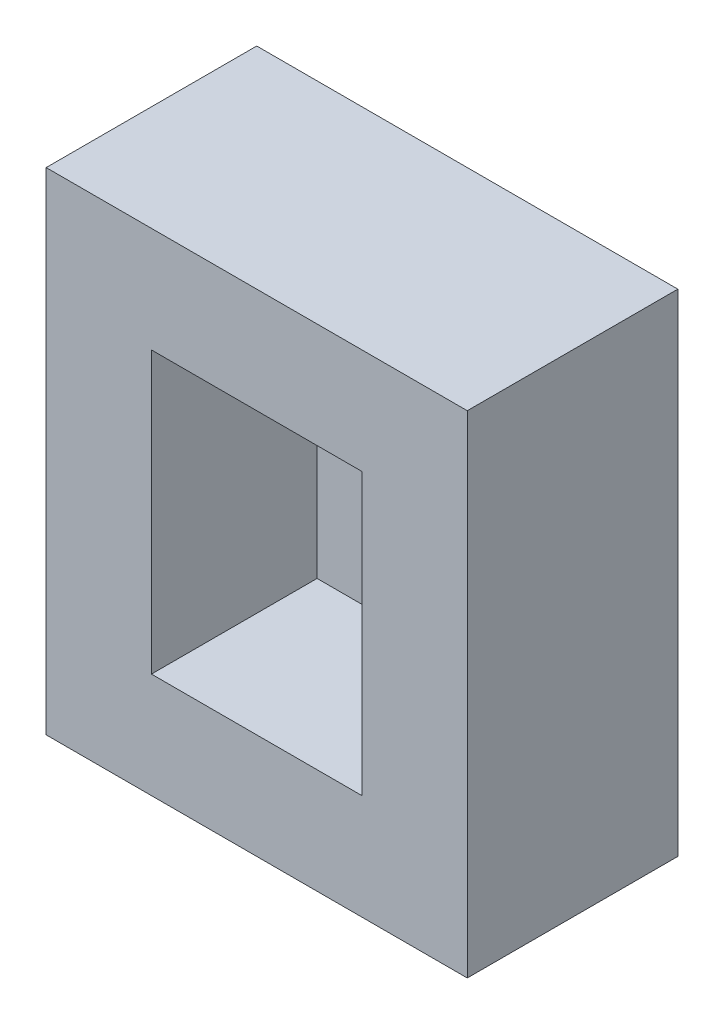
ISO-10303-21;
HEADER;
FILE_DESCRIPTION(('STEP AP214'),'2;1');
FILE_NAME('part.step','',(''),(''),'','','');
FILE_SCHEMA(('AUTOMOTIVE_DESIGN { 1 0 10303 214 1 1 1 1 }'));
ENDSEC;
DATA;
#1=APPLICATION_CONTEXT('core data for automotive mechanical design processes');
#2=APPLICATION_PROTOCOL_DEFINITION('international standard','automotive_design',2000,#1);
#3=PRODUCT_CONTEXT('',#1,'mechanical');
#4=PRODUCT('Part','Part','',(#3));
#5=PRODUCT_RELATED_PRODUCT_CATEGORY('part','',(#4));
#6=PRODUCT_DEFINITION_FORMATION('','',#4);
#7=PRODUCT_DEFINITION_CONTEXT('part definition',#1,'design');
#8=PRODUCT_DEFINITION('design','',#6,#7);
#9=PRODUCT_DEFINITION_SHAPE('','',#8);
#10=(LENGTH_UNIT() NAMED_UNIT(*) SI_UNIT(.MILLI.,.METRE.));
#11=(NAMED_UNIT(*) PLANE_ANGLE_UNIT() SI_UNIT($,.RADIAN.));
#12=(NAMED_UNIT(*) SI_UNIT($,.STERADIAN.) SOLID_ANGLE_UNIT());
#13=UNCERTAINTY_MEASURE_WITH_UNIT(LENGTH_MEASURE(1.E-05),#10,'distance_accuracy_value','');
#14=(GEOMETRIC_REPRESENTATION_CONTEXT(3) GLOBAL_UNCERTAINTY_ASSIGNED_CONTEXT((#13)) GLOBAL_UNIT_ASSIGNED_CONTEXT((#10,
#11,#12)) REPRESENTATION_CONTEXT('',''));
#15=CARTESIAN_POINT('',(0.,0.,0.));
#16=DIRECTION('',(0.,0.,1.));
#17=DIRECTION('',(1.,0.,0.));
#18=AXIS2_PLACEMENT_3D('',#15,#16,#17);
#19=CARTESIAN_POINT('',(0.,711.2,0.));
#20=DIRECTION('',(0.,0.,-1.));
#21=DIRECTION('',(-1.,0.,0.));
#22=AXIS2_PLACEMENT_3D('',#19,#20,#21);
#23=PLANE('',#22);
#24=DIRECTION('',(1.,0.,0.));
#25=VECTOR('',#24,1.);
#26=CARTESIAN_POINT('',(0.,0.,0.));
#27=LINE('',#26,#25);
#28=CARTESIAN_POINT('',(0.,0.,0.));
#29=VERTEX_POINT('',#28);
#30=CARTESIAN_POINT('',(609.6,0.,0.));
#31=VERTEX_POINT('',#30);
#32=EDGE_CURVE('E153',#29,#31,#27,.T.);
#33=ORIENTED_EDGE('',*,*,#32,.T.);
#34=DIRECTION('',(0.,-1.,0.));
#35=VECTOR('',#34,1.);
#36=CARTESIAN_POINT('',(609.6,711.2,0.));
#37=LINE('',#36,#35);
#38=CARTESIAN_POINT('',(609.6,711.2,0.));
#39=VERTEX_POINT('',#38);
#40=EDGE_CURVE('E48',#39,#31,#37,.T.);
#41=ORIENTED_EDGE('',*,*,#40,.F.);
#42=DIRECTION('',(1.,0.,0.));
#43=VECTOR('',#42,1.);
#44=CARTESIAN_POINT('',(0.,711.2,0.));
#45=LINE('',#44,#43);
#46=CARTESIAN_POINT('',(0.,711.2,0.));
#47=VERTEX_POINT('',#46);
#48=EDGE_CURVE('E157',#47,#39,#45,.T.);
#49=ORIENTED_EDGE('',*,*,#48,.F.);
#50=DIRECTION('',(0.,-1.,0.));
#51=VECTOR('',#50,1.);
#52=CARTESIAN_POINT('',(0.,711.2,0.));
#53=LINE('',#52,#51);
#54=EDGE_CURVE('E11',#47,#29,#53,.T.);
#55=ORIENTED_EDGE('',*,*,#54,.T.);
#56=EDGE_LOOP('',(#33,#41,#49,#55));
#57=FACE_BOUND('',#56,.T.);
#58=DIRECTION('',(1.,0.,0.));
#59=VECTOR('',#58,1.);
#60=CARTESIAN_POINT('',(152.4,558.8,0.));
#61=LINE('',#60,#59);
#62=CARTESIAN_POINT('',(152.4,558.8,0.));
#63=VERTEX_POINT('',#62);
#64=CARTESIAN_POINT('',(457.2,558.8,0.));
#65=VERTEX_POINT('',#64);
#66=EDGE_CURVE('E56',#63,#65,#61,.T.);
#67=ORIENTED_EDGE('',*,*,#66,.T.);
#68=DIRECTION('',(0.,1.,0.));
#69=VECTOR('',#68,1.);
#70=CARTESIAN_POINT('',(457.2,152.4,0.));
#71=LINE('',#70,#69);
#72=CARTESIAN_POINT('',(457.2,152.4,0.));
#73=VERTEX_POINT('',#72);
#74=EDGE_CURVE('E127',#73,#65,#71,.T.);
#75=ORIENTED_EDGE('',*,*,#74,.F.);
#76=DIRECTION('',(1.,0.,0.));
#77=VECTOR('',#76,1.);
#78=CARTESIAN_POINT('',(152.4,152.4,0.));
#79=LINE('',#78,#77);
#80=CARTESIAN_POINT('',(152.4,152.4,0.));
#81=VERTEX_POINT('',#80);
#82=EDGE_CURVE('E141',#81,#73,#79,.T.);
#83=ORIENTED_EDGE('',*,*,#82,.F.);
#84=DIRECTION('',(0.,1.,0.));
#85=VECTOR('',#84,1.);
#86=CARTESIAN_POINT('',(152.4,152.4,0.));
#87=LINE('',#86,#85);
#88=EDGE_CURVE('E120',#81,#63,#87,.T.);
#89=ORIENTED_EDGE('',*,*,#88,.T.);
#90=EDGE_LOOP('',(#67,#75,#83,#89));
#91=FACE_BOUND('',#90,.T.);
#92=ADVANCED_FACE('F39',(#57,#91),#23,.F.);
#93=CARTESIAN_POINT('',(0.,711.2,0.));
#94=DIRECTION('',(-1.,0.,0.));
#95=DIRECTION('',(0.,0.,1.));
#96=AXIS2_PLACEMENT_3D('',#93,#94,#95);
#97=PLANE('',#96);
#98=DIRECTION('',(0.,0.,-1.));
#99=VECTOR('',#98,1.);
#100=CARTESIAN_POINT('',(0.,0.,0.));
#101=LINE('',#100,#99);
#102=CARTESIAN_POINT('',(0.,0.,-304.8));
#103=VERTEX_POINT('',#102);
#104=EDGE_CURVE('E128',#29,#103,#101,.T.);
#105=ORIENTED_EDGE('',*,*,#104,.F.);
#106=ORIENTED_EDGE('',*,*,#54,.F.);
#107=DIRECTION('',(0.,0.,-1.));
#108=VECTOR('',#107,1.);
#109=CARTESIAN_POINT('',(0.,711.2,0.));
#110=LINE('',#109,#108);
#111=CARTESIAN_POINT('',(0.,711.2,-304.8));
#112=VERTEX_POINT('',#111);
#113=EDGE_CURVE('E150',#47,#112,#110,.T.);
#114=ORIENTED_EDGE('',*,*,#113,.T.);
#115=DIRECTION('',(0.,-1.,0.));
#116=VECTOR('',#115,1.);
#117=CARTESIAN_POINT('',(0.,711.2,-304.8));
#118=LINE('',#117,#116);
#119=EDGE_CURVE('E43',#112,#103,#118,.T.);
#120=ORIENTED_EDGE('',*,*,#119,.T.);
#121=EDGE_LOOP('',(#105,#106,#114,#120));
#122=FACE_BOUND('',#121,.T.);
#123=ADVANCED_FACE('F41',(#122),#97,.T.);
#124=CARTESIAN_POINT('',(609.6,711.2,0.));
#125=DIRECTION('',(-1.,0.,0.));
#126=DIRECTION('',(0.,0.,1.));
#127=AXIS2_PLACEMENT_3D('',#124,#125,#126);
#128=PLANE('',#127);
#129=DIRECTION('',(0.,0.,-1.));
#130=VECTOR('',#129,1.);
#131=CARTESIAN_POINT('',(609.6,0.,0.));
#132=LINE('',#131,#130);
#133=CARTESIAN_POINT('',(609.6,0.,-304.8));
#134=VERTEX_POINT('',#133);
#135=EDGE_CURVE('E164',#31,#134,#132,.T.);
#136=ORIENTED_EDGE('',*,*,#135,.T.);
#137=DIRECTION('',(0.,-1.,0.));
#138=VECTOR('',#137,1.);
#139=CARTESIAN_POINT('',(609.6,711.2,-304.8));
#140=LINE('',#139,#138);
#141=CARTESIAN_POINT('',(609.6,711.2,-304.8));
#142=VERTEX_POINT('',#141);
#143=EDGE_CURVE('E169',#142,#134,#140,.T.);
#144=ORIENTED_EDGE('',*,*,#143,.F.);
#145=DIRECTION('',(0.,0.,-1.));
#146=VECTOR('',#145,1.);
#147=CARTESIAN_POINT('',(609.6,711.2,0.));
#148=LINE('',#147,#146);
#149=EDGE_CURVE('E155',#39,#142,#148,.T.);
#150=ORIENTED_EDGE('',*,*,#149,.F.);
#151=ORIENTED_EDGE('',*,*,#40,.T.);
#152=EDGE_LOOP('',(#136,#144,#150,#151));
#153=FACE_BOUND('',#152,.T.);
#154=ADVANCED_FACE('F180',(#153),#128,.F.);
#155=CARTESIAN_POINT('',(0.,711.2,-304.8));
#156=DIRECTION('',(0.,0.,-1.));
#157=DIRECTION('',(-1.,0.,0.));
#158=AXIS2_PLACEMENT_3D('',#155,#156,#157);
#159=PLANE('',#158);
#160=DIRECTION('',(1.,0.,0.));
#161=VECTOR('',#160,1.);
#162=CARTESIAN_POINT('',(0.,0.,-304.8));
#163=LINE('',#162,#161);
#164=EDGE_CURVE('E161',#103,#134,#163,.T.);
#165=ORIENTED_EDGE('',*,*,#164,.F.);
#166=ORIENTED_EDGE('',*,*,#119,.F.);
#167=DIRECTION('',(1.,0.,0.));
#168=VECTOR('',#167,1.);
#169=CARTESIAN_POINT('',(0.,711.2,-304.8));
#170=LINE('',#169,#168);
#171=EDGE_CURVE('E152',#112,#142,#170,.T.);
#172=ORIENTED_EDGE('',*,*,#171,.T.);
#173=ORIENTED_EDGE('',*,*,#143,.T.);
#174=EDGE_LOOP('',(#165,#166,#172,#173));
#175=FACE_BOUND('',#174,.T.);
#176=ADVANCED_FACE('F172',(#175),#159,.T.);
#177=CARTESIAN_POINT('',(0.,711.2,0.));
#178=DIRECTION('',(0.,-1.,0.));
#179=DIRECTION('',(0.,0.,-1.));
#180=AXIS2_PLACEMENT_3D('',#177,#178,#179);
#181=PLANE('',#180);
#182=ORIENTED_EDGE('',*,*,#113,.F.);
#183=ORIENTED_EDGE('',*,*,#48,.T.);
#184=ORIENTED_EDGE('',*,*,#149,.T.);
#185=ORIENTED_EDGE('',*,*,#171,.F.);
#186=EDGE_LOOP('',(#182,#183,#184,#185));
#187=FACE_BOUND('',#186,.T.);
#188=ADVANCED_FACE('F182',(#187),#181,.F.);
#189=CARTESIAN_POINT('',(0.,0.,0.));
#190=DIRECTION('',(0.,-1.,0.));
#191=DIRECTION('',(0.,0.,-1.));
#192=AXIS2_PLACEMENT_3D('',#189,#190,#191);
#193=PLANE('',#192);
#194=ORIENTED_EDGE('',*,*,#104,.T.);
#195=ORIENTED_EDGE('',*,*,#164,.T.);
#196=ORIENTED_EDGE('',*,*,#135,.F.);
#197=ORIENTED_EDGE('',*,*,#32,.F.);
#198=EDGE_LOOP('',(#194,#195,#196,#197));
#199=FACE_BOUND('',#198,.T.);
#200=ADVANCED_FACE('F175',(#199),#193,.T.);
#201=CARTESIAN_POINT('',(152.4,558.8,-239.776));
#202=DIRECTION('',(0.,-1.,0.));
#203=DIRECTION('',(0.,0.,-1.));
#204=AXIS2_PLACEMENT_3D('',#201,#202,#203);
#205=PLANE('',#204);
#206=ORIENTED_EDGE('',*,*,#66,.F.);
#207=DIRECTION('',(0.,0.,1.));
#208=VECTOR('',#207,1.);
#209=CARTESIAN_POINT('',(152.4,558.8,-239.776));
#210=LINE('',#209,#208);
#211=CARTESIAN_POINT('',(152.4,558.8,-239.776));
#212=VERTEX_POINT('',#211);
#213=EDGE_CURVE('E115',#212,#63,#210,.T.);
#214=ORIENTED_EDGE('',*,*,#213,.F.);
#215=DIRECTION('',(1.,0.,0.));
#216=VECTOR('',#215,1.);
#217=CARTESIAN_POINT('',(152.4,558.8,-239.776));
#218=LINE('',#217,#216);
#219=CARTESIAN_POINT('',(457.2,558.8,-239.776));
#220=VERTEX_POINT('',#219);
#221=EDGE_CURVE('E110',#212,#220,#218,.T.);
#222=ORIENTED_EDGE('',*,*,#221,.T.);
#223=DIRECTION('',(0.,0.,1.));
#224=VECTOR('',#223,1.);
#225=CARTESIAN_POINT('',(457.2,558.8,-239.776));
#226=LINE('',#225,#224);
#227=EDGE_CURVE('E113',#220,#65,#226,.T.);
#228=ORIENTED_EDGE('',*,*,#227,.T.);
#229=EDGE_LOOP('',(#206,#214,#222,#228));
#230=FACE_BOUND('',#229,.T.);
#231=ADVANCED_FACE('F112',(#230),#205,.T.);
#232=CARTESIAN_POINT('',(457.2,152.4,-239.776));
#233=DIRECTION('',(1.,0.,0.));
#234=DIRECTION('',(0.,0.,-1.));
#235=AXIS2_PLACEMENT_3D('',#232,#233,#234);
#236=PLANE('',#235);
#237=ORIENTED_EDGE('',*,*,#74,.T.);
#238=ORIENTED_EDGE('',*,*,#227,.F.);
#239=DIRECTION('',(0.,1.,0.));
#240=VECTOR('',#239,1.);
#241=CARTESIAN_POINT('',(457.2,152.4,-239.776));
#242=LINE('',#241,#240);
#243=CARTESIAN_POINT('',(457.2,152.4,-239.776));
#244=VERTEX_POINT('',#243);
#245=EDGE_CURVE('E119',#244,#220,#242,.T.);
#246=ORIENTED_EDGE('',*,*,#245,.F.);
#247=DIRECTION('',(0.,0.,1.));
#248=VECTOR('',#247,1.);
#249=CARTESIAN_POINT('',(457.2,152.4,-239.776));
#250=LINE('',#249,#248);
#251=EDGE_CURVE('E129',#244,#73,#250,.T.);
#252=ORIENTED_EDGE('',*,*,#251,.T.);
#253=EDGE_LOOP('',(#237,#238,#246,#252));
#254=FACE_BOUND('',#253,.T.);
#255=ADVANCED_FACE('F124',(#254),#236,.F.);
#256=CARTESIAN_POINT('',(152.4,152.4,-239.776));
#257=DIRECTION('',(0.,-1.,0.));
#258=DIRECTION('',(0.,0.,-1.));
#259=AXIS2_PLACEMENT_3D('',#256,#257,#258);
#260=PLANE('',#259);
#261=ORIENTED_EDGE('',*,*,#82,.T.);
#262=ORIENTED_EDGE('',*,*,#251,.F.);
#263=DIRECTION('',(1.,0.,0.));
#264=VECTOR('',#263,1.);
#265=CARTESIAN_POINT('',(152.4,152.4,-239.776));
#266=LINE('',#265,#264);
#267=CARTESIAN_POINT('',(152.4,152.4,-239.776));
#268=VERTEX_POINT('',#267);
#269=EDGE_CURVE('E133',#268,#244,#266,.T.);
#270=ORIENTED_EDGE('',*,*,#269,.F.);
#271=DIRECTION('',(0.,0.,1.));
#272=VECTOR('',#271,1.);
#273=CARTESIAN_POINT('',(152.4,152.4,-239.776));
#274=LINE('',#273,#272);
#275=EDGE_CURVE('E147',#268,#81,#274,.T.);
#276=ORIENTED_EDGE('',*,*,#275,.T.);
#277=EDGE_LOOP('',(#261,#262,#270,#276));
#278=FACE_BOUND('',#277,.T.);
#279=ADVANCED_FACE('F238',(#278),#260,.F.);
#280=CARTESIAN_POINT('',(152.4,152.4,-239.776));
#281=DIRECTION('',(1.,0.,0.));
#282=DIRECTION('',(0.,0.,-1.));
#283=AXIS2_PLACEMENT_3D('',#280,#281,#282);
#284=PLANE('',#283);
#285=ORIENTED_EDGE('',*,*,#88,.F.);
#286=ORIENTED_EDGE('',*,*,#275,.F.);
#287=DIRECTION('',(0.,1.,0.));
#288=VECTOR('',#287,1.);
#289=CARTESIAN_POINT('',(152.4,152.4,-239.776));
#290=LINE('',#289,#288);
#291=EDGE_CURVE('E135',#268,#212,#290,.T.);
#292=ORIENTED_EDGE('',*,*,#291,.T.);
#293=ORIENTED_EDGE('',*,*,#213,.T.);
#294=EDGE_LOOP('',(#285,#286,#292,#293));
#295=FACE_BOUND('',#294,.T.);
#296=ADVANCED_FACE('F247',(#295),#284,.T.);
#297=CARTESIAN_POINT('',(0.,0.,-239.776));
#298=DIRECTION('',(0.,0.,1.));
#299=DIRECTION('',(1.,0.,0.));
#300=AXIS2_PLACEMENT_3D('',#297,#298,#299);
#301=PLANE('',#300);
#302=ORIENTED_EDGE('',*,*,#221,.F.);
#303=ORIENTED_EDGE('',*,*,#291,.F.);
#304=ORIENTED_EDGE('',*,*,#269,.T.);
#305=ORIENTED_EDGE('',*,*,#245,.T.);
#306=EDGE_LOOP('',(#302,#303,#304,#305));
#307=FACE_BOUND('',#306,.T.);
#308=ADVANCED_FACE('F131',(#307),#301,.T.);
#309=CLOSED_SHELL('',(#92,#123,#154,#176,#188,#200,#231,#255,#279,#296,#308));
#310=MANIFOLD_SOLID_BREP('B2',#309);
#311=ADVANCED_BREP_SHAPE_REPRESENTATION('',(#18,#310),#14);
#312=SHAPE_DEFINITION_REPRESENTATION(#9,#311);
ENDSEC;
END-ISO-10303-21;
